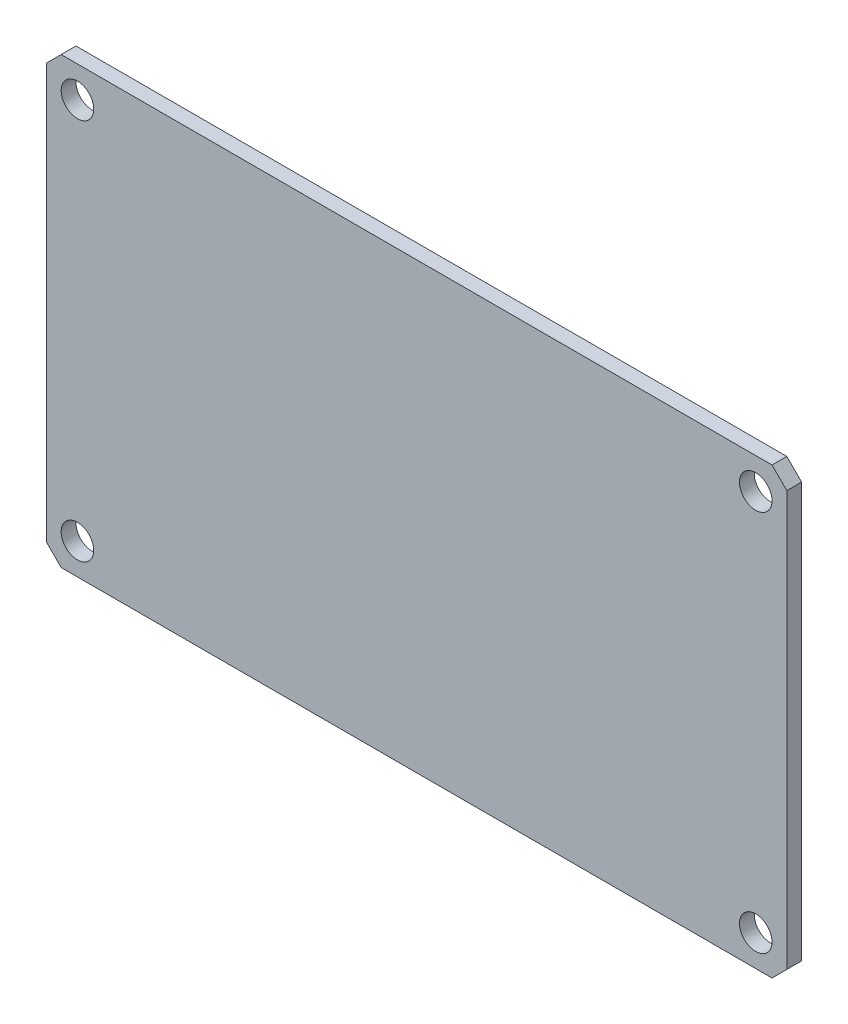
ISO-10303-21;
HEADER;
FILE_DESCRIPTION(('STEP AP214'),'2;1');
FILE_NAME('part.step','',(''),(''),'','','');
FILE_SCHEMA(('AUTOMOTIVE_DESIGN { 1 0 10303 214 1 1 1 1 }'));
ENDSEC;
DATA;
#1=APPLICATION_CONTEXT('core data for automotive mechanical design processes');
#2=APPLICATION_PROTOCOL_DEFINITION('international standard','automotive_design',2000,#1);
#3=PRODUCT_CONTEXT('',#1,'mechanical');
#4=PRODUCT('Part','Part','',(#3));
#5=PRODUCT_RELATED_PRODUCT_CATEGORY('part','',(#4));
#6=PRODUCT_DEFINITION_FORMATION('','',#4);
#7=PRODUCT_DEFINITION_CONTEXT('part definition',#1,'design');
#8=PRODUCT_DEFINITION('design','',#6,#7);
#9=PRODUCT_DEFINITION_SHAPE('','',#8);
#10=(LENGTH_UNIT() NAMED_UNIT(*) SI_UNIT(.MILLI.,.METRE.));
#11=(NAMED_UNIT(*) PLANE_ANGLE_UNIT() SI_UNIT($,.RADIAN.));
#12=(NAMED_UNIT(*) SI_UNIT($,.STERADIAN.) SOLID_ANGLE_UNIT());
#13=UNCERTAINTY_MEASURE_WITH_UNIT(LENGTH_MEASURE(1.E-05),#10,'distance_accuracy_value','');
#14=(GEOMETRIC_REPRESENTATION_CONTEXT(3) GLOBAL_UNCERTAINTY_ASSIGNED_CONTEXT((#13)) GLOBAL_UNIT_ASSIGNED_CONTEXT((#10,
#11,#12)) REPRESENTATION_CONTEXT('',''));
#15=CARTESIAN_POINT('',(0.,0.,0.));
#16=DIRECTION('',(0.,0.,1.));
#17=DIRECTION('',(1.,0.,0.));
#18=AXIS2_PLACEMENT_3D('',#15,#16,#17);
#19=CARTESIAN_POINT('',(37.5,22.5,1.5));
#20=DIRECTION('',(-1.,0.,0.));
#21=DIRECTION('',(0.,-1.,0.));
#22=AXIS2_PLACEMENT_3D('',#19,#20,#21);
#23=PLANE('',#22);
#24=DIRECTION('',(0.,1.,0.));
#25=VECTOR('',#24,1.);
#26=CARTESIAN_POINT('',(37.5,22.5,0.));
#27=LINE('',#26,#25);
#28=CARTESIAN_POINT('',(37.5,-21.,0.));
#29=VERTEX_POINT('',#28);
#30=CARTESIAN_POINT('',(37.5,21.,0.));
#31=VERTEX_POINT('',#30);
#32=EDGE_CURVE('E120',#29,#31,#27,.T.);
#33=ORIENTED_EDGE('',*,*,#32,.T.);
#34=DIRECTION('',(0.,0.,1.));
#35=VECTOR('',#34,1.);
#36=CARTESIAN_POINT('',(37.5,21.,0.));
#37=LINE('',#36,#35);
#38=CARTESIAN_POINT('',(37.5,21.,1.5));
#39=VERTEX_POINT('',#38);
#40=EDGE_CURVE('E168',#31,#39,#37,.T.);
#41=ORIENTED_EDGE('',*,*,#40,.T.);
#42=DIRECTION('',(0.,1.,0.));
#43=VECTOR('',#42,1.);
#44=CARTESIAN_POINT('',(37.5,22.5,1.5));
#45=LINE('',#44,#43);
#46=CARTESIAN_POINT('',(37.5,-21.,1.5));
#47=VERTEX_POINT('',#46);
#48=EDGE_CURVE('E119',#47,#39,#45,.T.);
#49=ORIENTED_EDGE('',*,*,#48,.F.);
#50=DIRECTION('',(0.,0.,1.));
#51=VECTOR('',#50,1.);
#52=CARTESIAN_POINT('',(37.5,-21.,0.));
#53=LINE('',#52,#51);
#54=EDGE_CURVE('E154',#29,#47,#53,.T.);
#55=ORIENTED_EDGE('',*,*,#54,.F.);
#56=EDGE_LOOP('',(#33,#41,#49,#55));
#57=FACE_BOUND('',#56,.T.);
#58=ADVANCED_FACE('F33',(#57),#23,.F.);
#59=CARTESIAN_POINT('',(-37.5,22.5,1.5));
#60=DIRECTION('',(0.,-1.,0.));
#61=DIRECTION('',(0.,0.,-1.));
#62=AXIS2_PLACEMENT_3D('',#59,#60,#61);
#63=PLANE('',#62);
#64=DIRECTION('',(-1.,0.,0.));
#65=VECTOR('',#64,1.);
#66=CARTESIAN_POINT('',(-37.5,22.5,0.));
#67=LINE('',#66,#65);
#68=CARTESIAN_POINT('',(36.,22.5,0.));
#69=VERTEX_POINT('',#68);
#70=CARTESIAN_POINT('',(-36.,22.5,0.));
#71=VERTEX_POINT('',#70);
#72=EDGE_CURVE('E117',#69,#71,#67,.T.);
#73=ORIENTED_EDGE('',*,*,#72,.T.);
#74=DIRECTION('',(0.,0.,1.));
#75=VECTOR('',#74,1.);
#76=CARTESIAN_POINT('',(-36.,22.5,0.));
#77=LINE('',#76,#75);
#78=CARTESIAN_POINT('',(-36.,22.5,1.5));
#79=VERTEX_POINT('',#78);
#80=EDGE_CURVE('E49',#71,#79,#77,.T.);
#81=ORIENTED_EDGE('',*,*,#80,.T.);
#82=DIRECTION('',(-1.,0.,0.));
#83=VECTOR('',#82,1.);
#84=CARTESIAN_POINT('',(-37.5,22.5,1.5));
#85=LINE('',#84,#83);
#86=CARTESIAN_POINT('',(36.,22.5,1.5));
#87=VERTEX_POINT('',#86);
#88=EDGE_CURVE('E127',#87,#79,#85,.T.);
#89=ORIENTED_EDGE('',*,*,#88,.F.);
#90=DIRECTION('',(0.,0.,1.));
#91=VECTOR('',#90,1.);
#92=CARTESIAN_POINT('',(36.,22.5,0.));
#93=LINE('',#92,#91);
#94=EDGE_CURVE('E166',#69,#87,#93,.T.);
#95=ORIENTED_EDGE('',*,*,#94,.F.);
#96=EDGE_LOOP('',(#73,#81,#89,#95));
#97=FACE_BOUND('',#96,.T.);
#98=ADVANCED_FACE('F185',(#97),#63,.F.);
#99=CARTESIAN_POINT('',(-37.5,22.5,1.5));
#100=DIRECTION('',(1.,0.,0.));
#101=DIRECTION('',(0.,0.,-1.));
#102=AXIS2_PLACEMENT_3D('',#99,#100,#101);
#103=PLANE('',#102);
#104=DIRECTION('',(0.,-1.,0.));
#105=VECTOR('',#104,1.);
#106=CARTESIAN_POINT('',(-37.5,22.5,1.5));
#107=LINE('',#106,#105);
#108=CARTESIAN_POINT('',(-37.5,21.,1.5));
#109=VERTEX_POINT('',#108);
#110=CARTESIAN_POINT('',(-37.5,-21.,1.5));
#111=VERTEX_POINT('',#110);
#112=EDGE_CURVE('E41',#109,#111,#107,.T.);
#113=ORIENTED_EDGE('',*,*,#112,.F.);
#114=DIRECTION('',(0.,0.,1.));
#115=VECTOR('',#114,1.);
#116=CARTESIAN_POINT('',(-37.5,21.,0.));
#117=LINE('',#116,#115);
#118=CARTESIAN_POINT('',(-37.5,21.,0.));
#119=VERTEX_POINT('',#118);
#120=EDGE_CURVE('E99',#119,#109,#117,.T.);
#121=ORIENTED_EDGE('',*,*,#120,.F.);
#122=DIRECTION('',(0.,-1.,0.));
#123=VECTOR('',#122,1.);
#124=CARTESIAN_POINT('',(-37.5,22.5,0.));
#125=LINE('',#124,#123);
#126=CARTESIAN_POINT('',(-37.5,-21.,0.));
#127=VERTEX_POINT('',#126);
#128=EDGE_CURVE('E111',#119,#127,#125,.T.);
#129=ORIENTED_EDGE('',*,*,#128,.T.);
#130=DIRECTION('',(0.,0.,1.));
#131=VECTOR('',#130,1.);
#132=CARTESIAN_POINT('',(-37.5,-21.,0.));
#133=LINE('',#132,#131);
#134=EDGE_CURVE('E57',#127,#111,#133,.T.);
#135=ORIENTED_EDGE('',*,*,#134,.T.);
#136=EDGE_LOOP('',(#113,#121,#129,#135));
#137=FACE_BOUND('',#136,.T.);
#138=ADVANCED_FACE('F110',(#137),#103,.F.);
#139=CARTESIAN_POINT('',(-37.5,-22.5,1.5));
#140=DIRECTION('',(0.,1.,0.));
#141=DIRECTION('',(0.,0.,1.));
#142=AXIS2_PLACEMENT_3D('',#139,#140,#141);
#143=PLANE('',#142);
#144=DIRECTION('',(1.,0.,0.));
#145=VECTOR('',#144,1.);
#146=CARTESIAN_POINT('',(-37.5,-22.5,0.));
#147=LINE('',#146,#145);
#148=CARTESIAN_POINT('',(-36.,-22.5,0.));
#149=VERTEX_POINT('',#148);
#150=CARTESIAN_POINT('',(36.,-22.5,0.));
#151=VERTEX_POINT('',#150);
#152=EDGE_CURVE('E36',#149,#151,#147,.T.);
#153=ORIENTED_EDGE('',*,*,#152,.T.);
#154=DIRECTION('',(0.,0.,1.));
#155=VECTOR('',#154,1.);
#156=CARTESIAN_POINT('',(36.,-22.5,0.));
#157=LINE('',#156,#155);
#158=CARTESIAN_POINT('',(36.,-22.5,1.5));
#159=VERTEX_POINT('',#158);
#160=EDGE_CURVE('E158',#151,#159,#157,.T.);
#161=ORIENTED_EDGE('',*,*,#160,.T.);
#162=DIRECTION('',(1.,0.,0.));
#163=VECTOR('',#162,1.);
#164=CARTESIAN_POINT('',(-37.5,-22.5,1.5));
#165=LINE('',#164,#163);
#166=CARTESIAN_POINT('',(-36.,-22.5,1.5));
#167=VERTEX_POINT('',#166);
#168=EDGE_CURVE('E11',#167,#159,#165,.T.);
#169=ORIENTED_EDGE('',*,*,#168,.F.);
#170=DIRECTION('',(0.,0.,1.));
#171=VECTOR('',#170,1.);
#172=CARTESIAN_POINT('',(-36.,-22.5,0.));
#173=LINE('',#172,#171);
#174=EDGE_CURVE('E144',#149,#167,#173,.T.);
#175=ORIENTED_EDGE('',*,*,#174,.F.);
#176=EDGE_LOOP('',(#153,#161,#169,#175));
#177=FACE_BOUND('',#176,.T.);
#178=ADVANCED_FACE('F200',(#177),#143,.F.);
#179=CARTESIAN_POINT('',(0.,0.,1.5));
#180=DIRECTION('',(0.,0.,1.));
#181=DIRECTION('',(1.,0.,0.));
#182=AXIS2_PLACEMENT_3D('',#179,#180,#181);
#183=PLANE('',#182);
#184=DIRECTION('',(0.707106781186547,0.707106781186547,0.));
#185=VECTOR('',#184,1.);
#186=CARTESIAN_POINT('',(-36.,22.5,1.5));
#187=LINE('',#186,#185);
#188=EDGE_CURVE('E105',#109,#79,#187,.T.);
#189=ORIENTED_EDGE('',*,*,#188,.F.);
#190=ORIENTED_EDGE('',*,*,#112,.T.);
#191=DIRECTION('',(-0.707106781186547,0.707106781186547,0.));
#192=VECTOR('',#191,1.);
#193=CARTESIAN_POINT('',(-36.,-22.5,1.5));
#194=LINE('',#193,#192);
#195=EDGE_CURVE('E147',#167,#111,#194,.T.);
#196=ORIENTED_EDGE('',*,*,#195,.F.);
#197=ORIENTED_EDGE('',*,*,#168,.T.);
#198=DIRECTION('',(-0.707106781186547,-0.707106781186547,0.));
#199=VECTOR('',#198,1.);
#200=CARTESIAN_POINT('',(36.,-22.5,1.5));
#201=LINE('',#200,#199);
#202=EDGE_CURVE('E143',#47,#159,#201,.T.);
#203=ORIENTED_EDGE('',*,*,#202,.F.);
#204=ORIENTED_EDGE('',*,*,#48,.T.);
#205=DIRECTION('',(0.707106781186547,-0.707106781186547,0.));
#206=VECTOR('',#205,1.);
#207=CARTESIAN_POINT('',(36.,22.5,1.5));
#208=LINE('',#207,#206);
#209=EDGE_CURVE('E172',#87,#39,#208,.T.);
#210=ORIENTED_EDGE('',*,*,#209,.F.);
#211=ORIENTED_EDGE('',*,*,#88,.T.);
#212=EDGE_LOOP('',(#189,#190,#196,#197,#203,#204,#210,#211));
#213=FACE_BOUND('',#212,.T.);
#214=CARTESIAN_POINT('',(34.35,19.35,1.5));
#215=DIRECTION('',(0.,0.,1.));
#216=DIRECTION('',(-1.,0.,0.));
#217=AXIS2_PLACEMENT_3D('',#214,#215,#216);
#218=CIRCLE('',#217,1.65);
#219=CARTESIAN_POINT('',(32.7,19.35,1.5));
#220=VERTEX_POINT('',#219);
#221=EDGE_CURVE('E157',#220,#220,#218,.T.);
#222=ORIENTED_EDGE('',*,*,#221,.F.);
#223=EDGE_LOOP('',(#222));
#224=FACE_BOUND('',#223,.T.);
#225=CARTESIAN_POINT('',(34.35,-19.35,1.5));
#226=DIRECTION('',(0.,0.,1.));
#227=DIRECTION('',(1.,0.,0.));
#228=AXIS2_PLACEMENT_3D('',#225,#226,#227);
#229=CIRCLE('',#228,1.65);
#230=CARTESIAN_POINT('',(36.,-19.35,1.5));
#231=VERTEX_POINT('',#230);
#232=EDGE_CURVE('E150',#231,#231,#229,.T.);
#233=ORIENTED_EDGE('',*,*,#232,.F.);
#234=EDGE_LOOP('',(#233));
#235=FACE_BOUND('',#234,.T.);
#236=CARTESIAN_POINT('',(-34.35,-19.35,1.5));
#237=DIRECTION('',(0.,0.,1.));
#238=DIRECTION('',(-1.,0.,0.));
#239=AXIS2_PLACEMENT_3D('',#236,#237,#238);
#240=CIRCLE('',#239,1.65);
#241=CARTESIAN_POINT('',(-36.,-19.35,1.5));
#242=VERTEX_POINT('',#241);
#243=EDGE_CURVE('E137',#242,#242,#240,.T.);
#244=ORIENTED_EDGE('',*,*,#243,.F.);
#245=EDGE_LOOP('',(#244));
#246=FACE_BOUND('',#245,.T.);
#247=CARTESIAN_POINT('',(-34.35,19.35,1.5));
#248=DIRECTION('',(0.,0.,1.));
#249=DIRECTION('',(1.,0.,0.));
#250=AXIS2_PLACEMENT_3D('',#247,#248,#249);
#251=CIRCLE('',#250,1.65);
#252=CARTESIAN_POINT('',(-32.7,19.35,1.5));
#253=VERTEX_POINT('',#252);
#254=EDGE_CURVE('E132',#253,#253,#251,.T.);
#255=ORIENTED_EDGE('',*,*,#254,.F.);
#256=EDGE_LOOP('',(#255));
#257=FACE_BOUND('',#256,.T.);
#258=ADVANCED_FACE('F188',(#213,#224,#235,#246,#257),#183,.T.);
#259=CARTESIAN_POINT('',(0.,0.,0.));
#260=DIRECTION('',(0.,0.,1.));
#261=DIRECTION('',(1.,0.,0.));
#262=AXIS2_PLACEMENT_3D('',#259,#260,#261);
#263=PLANE('',#262);
#264=CARTESIAN_POINT('',(34.35,19.35,0.));
#265=DIRECTION('',(0.,0.,1.));
#266=DIRECTION('',(-1.,0.,0.));
#267=AXIS2_PLACEMENT_3D('',#264,#265,#266);
#268=CIRCLE('',#267,1.65);
#269=CARTESIAN_POINT('',(32.7,19.35,0.));
#270=VERTEX_POINT('',#269);
#271=EDGE_CURVE('E174',#270,#270,#268,.T.);
#272=ORIENTED_EDGE('',*,*,#271,.T.);
#273=EDGE_LOOP('',(#272));
#274=FACE_BOUND('',#273,.T.);
#275=CARTESIAN_POINT('',(34.35,-19.35,0.));
#276=DIRECTION('',(0.,0.,1.));
#277=DIRECTION('',(1.,0.,0.));
#278=AXIS2_PLACEMENT_3D('',#275,#276,#277);
#279=CIRCLE('',#278,1.65);
#280=CARTESIAN_POINT('',(36.,-19.35,0.));
#281=VERTEX_POINT('',#280);
#282=EDGE_CURVE('E153',#281,#281,#279,.T.);
#283=ORIENTED_EDGE('',*,*,#282,.T.);
#284=EDGE_LOOP('',(#283));
#285=FACE_BOUND('',#284,.T.);
#286=CARTESIAN_POINT('',(-34.35,-19.35,0.));
#287=DIRECTION('',(0.,0.,1.));
#288=DIRECTION('',(-1.,0.,0.));
#289=AXIS2_PLACEMENT_3D('',#286,#287,#288);
#290=CIRCLE('',#289,1.65);
#291=CARTESIAN_POINT('',(-36.,-19.35,0.));
#292=VERTEX_POINT('',#291);
#293=EDGE_CURVE('E140',#292,#292,#290,.T.);
#294=ORIENTED_EDGE('',*,*,#293,.T.);
#295=EDGE_LOOP('',(#294));
#296=FACE_BOUND('',#295,.T.);
#297=CARTESIAN_POINT('',(-34.35,19.35,0.));
#298=DIRECTION('',(0.,0.,1.));
#299=DIRECTION('',(1.,0.,0.));
#300=AXIS2_PLACEMENT_3D('',#297,#298,#299);
#301=CIRCLE('',#300,1.65);
#302=CARTESIAN_POINT('',(-32.7,19.35,0.));
#303=VERTEX_POINT('',#302);
#304=EDGE_CURVE('E124',#303,#303,#301,.T.);
#305=ORIENTED_EDGE('',*,*,#304,.T.);
#306=EDGE_LOOP('',(#305));
#307=FACE_BOUND('',#306,.T.);
#308=ORIENTED_EDGE('',*,*,#128,.F.);
#309=DIRECTION('',(0.707106781186547,0.707106781186547,0.));
#310=VECTOR('',#309,1.);
#311=CARTESIAN_POINT('',(-36.,22.5,0.));
#312=LINE('',#311,#310);
#313=EDGE_CURVE('E96',#119,#71,#312,.T.);
#314=ORIENTED_EDGE('',*,*,#313,.T.);
#315=ORIENTED_EDGE('',*,*,#72,.F.);
#316=DIRECTION('',(0.707106781186547,-0.707106781186547,0.));
#317=VECTOR('',#316,1.);
#318=CARTESIAN_POINT('',(36.,22.5,0.));
#319=LINE('',#318,#317);
#320=EDGE_CURVE('E169',#69,#31,#319,.T.);
#321=ORIENTED_EDGE('',*,*,#320,.T.);
#322=ORIENTED_EDGE('',*,*,#32,.F.);
#323=DIRECTION('',(-0.707106781186547,-0.707106781186547,0.));
#324=VECTOR('',#323,1.);
#325=CARTESIAN_POINT('',(36.,-22.5,0.));
#326=LINE('',#325,#324);
#327=EDGE_CURVE('E161',#29,#151,#326,.T.);
#328=ORIENTED_EDGE('',*,*,#327,.T.);
#329=ORIENTED_EDGE('',*,*,#152,.F.);
#330=DIRECTION('',(-0.707106781186547,0.707106781186547,0.));
#331=VECTOR('',#330,1.);
#332=CARTESIAN_POINT('',(-36.,-22.5,0.));
#333=LINE('',#332,#331);
#334=EDGE_CURVE('E116',#149,#127,#333,.T.);
#335=ORIENTED_EDGE('',*,*,#334,.T.);
#336=EDGE_LOOP('',(#308,#314,#315,#321,#322,#328,#329,#335));
#337=FACE_BOUND('',#336,.T.);
#338=ADVANCED_FACE('F114',(#274,#285,#296,#307,#337),#263,.F.);
#339=CARTESIAN_POINT('',(-34.35,19.35,0.));
#340=DIRECTION('',(0.,0.,1.));
#341=DIRECTION('',(1.,0.,0.));
#342=AXIS2_PLACEMENT_3D('',#339,#340,#341);
#343=CYLINDRICAL_SURFACE('',#342,1.65);
#344=ORIENTED_EDGE('',*,*,#304,.F.);
#345=EDGE_LOOP('',(#344));
#346=FACE_BOUND('',#345,.T.);
#347=ORIENTED_EDGE('',*,*,#254,.T.);
#348=EDGE_LOOP('',(#347));
#349=FACE_BOUND('',#348,.T.);
#350=ADVANCED_FACE('F229',(#346,#349),#343,.F.);
#351=CARTESIAN_POINT('',(-34.35,-19.35,0.));
#352=DIRECTION('',(0.,0.,1.));
#353=DIRECTION('',(1.,0.,0.));
#354=AXIS2_PLACEMENT_3D('',#351,#352,#353);
#355=CYLINDRICAL_SURFACE('',#354,1.65);
#356=ORIENTED_EDGE('',*,*,#293,.F.);
#357=EDGE_LOOP('',(#356));
#358=FACE_BOUND('',#357,.T.);
#359=ORIENTED_EDGE('',*,*,#243,.T.);
#360=EDGE_LOOP('',(#359));
#361=FACE_BOUND('',#360,.T.);
#362=ADVANCED_FACE('F235',(#358,#361),#355,.F.);
#363=CARTESIAN_POINT('',(-36.,-22.5,0.));
#364=DIRECTION('',(0.707106781186548,0.707106781186548,0.));
#365=DIRECTION('',(-0.707106781186548,0.707106781186548,0.));
#366=AXIS2_PLACEMENT_3D('',#363,#364,#365);
#367=PLANE('',#366);
#368=ORIENTED_EDGE('',*,*,#195,.T.);
#369=ORIENTED_EDGE('',*,*,#134,.F.);
#370=ORIENTED_EDGE('',*,*,#334,.F.);
#371=ORIENTED_EDGE('',*,*,#174,.T.);
#372=EDGE_LOOP('',(#368,#369,#370,#371));
#373=FACE_BOUND('',#372,.T.);
#374=ADVANCED_FACE('F203',(#373),#367,.F.);
#375=CARTESIAN_POINT('',(34.35,-19.35,0.));
#376=DIRECTION('',(0.,0.,1.));
#377=DIRECTION('',(1.,0.,0.));
#378=AXIS2_PLACEMENT_3D('',#375,#376,#377);
#379=CYLINDRICAL_SURFACE('',#378,1.65);
#380=ORIENTED_EDGE('',*,*,#282,.F.);
#381=EDGE_LOOP('',(#380));
#382=FACE_BOUND('',#381,.T.);
#383=ORIENTED_EDGE('',*,*,#232,.T.);
#384=EDGE_LOOP('',(#383));
#385=FACE_BOUND('',#384,.T.);
#386=ADVANCED_FACE('F206',(#382,#385),#379,.F.);
#387=CARTESIAN_POINT('',(36.,-22.5,0.));
#388=DIRECTION('',(-0.707106781186548,0.707106781186548,0.));
#389=DIRECTION('',(-0.707106781186548,-0.707106781186548,0.));
#390=AXIS2_PLACEMENT_3D('',#387,#388,#389);
#391=PLANE('',#390);
#392=ORIENTED_EDGE('',*,*,#202,.T.);
#393=ORIENTED_EDGE('',*,*,#160,.F.);
#394=ORIENTED_EDGE('',*,*,#327,.F.);
#395=ORIENTED_EDGE('',*,*,#54,.T.);
#396=EDGE_LOOP('',(#392,#393,#394,#395));
#397=FACE_BOUND('',#396,.T.);
#398=ADVANCED_FACE('F204',(#397),#391,.F.);
#399=CARTESIAN_POINT('',(36.,22.5,0.));
#400=DIRECTION('',(-0.707106781186548,-0.707106781186548,0.));
#401=DIRECTION('',(0.707106781186548,-0.707106781186548,0.));
#402=AXIS2_PLACEMENT_3D('',#399,#400,#401);
#403=PLANE('',#402);
#404=ORIENTED_EDGE('',*,*,#209,.T.);
#405=ORIENTED_EDGE('',*,*,#40,.F.);
#406=ORIENTED_EDGE('',*,*,#320,.F.);
#407=ORIENTED_EDGE('',*,*,#94,.T.);
#408=EDGE_LOOP('',(#404,#405,#406,#407));
#409=FACE_BOUND('',#408,.T.);
#410=ADVANCED_FACE('F193',(#409),#403,.F.);
#411=CARTESIAN_POINT('',(34.35,19.35,0.));
#412=DIRECTION('',(0.,0.,1.));
#413=DIRECTION('',(1.,0.,0.));
#414=AXIS2_PLACEMENT_3D('',#411,#412,#413);
#415=CYLINDRICAL_SURFACE('',#414,1.65);
#416=ORIENTED_EDGE('',*,*,#271,.F.);
#417=EDGE_LOOP('',(#416));
#418=FACE_BOUND('',#417,.T.);
#419=ORIENTED_EDGE('',*,*,#221,.T.);
#420=EDGE_LOOP('',(#419));
#421=FACE_BOUND('',#420,.T.);
#422=ADVANCED_FACE('F212',(#418,#421),#415,.F.);
#423=CARTESIAN_POINT('',(-36.,22.5,0.));
#424=DIRECTION('',(0.707106781186548,-0.707106781186548,0.));
#425=DIRECTION('',(0.707106781186548,0.707106781186548,0.));
#426=AXIS2_PLACEMENT_3D('',#423,#424,#425);
#427=PLANE('',#426);
#428=ORIENTED_EDGE('',*,*,#188,.T.);
#429=ORIENTED_EDGE('',*,*,#80,.F.);
#430=ORIENTED_EDGE('',*,*,#313,.F.);
#431=ORIENTED_EDGE('',*,*,#120,.T.);
#432=EDGE_LOOP('',(#428,#429,#430,#431));
#433=FACE_BOUND('',#432,.T.);
#434=ADVANCED_FACE('F98',(#433),#427,.F.);
#435=CLOSED_SHELL('',(#58,#98,#138,#178,#258,#338,#350,#362,#374,#386,#398,#410,#422,#434));
#436=MANIFOLD_SOLID_BREP('B2',#435);
#437=ADVANCED_BREP_SHAPE_REPRESENTATION('',(#18,#436),#14);
#438=SHAPE_DEFINITION_REPRESENTATION(#9,#437);
ENDSEC;
END-ISO-10303-21;
